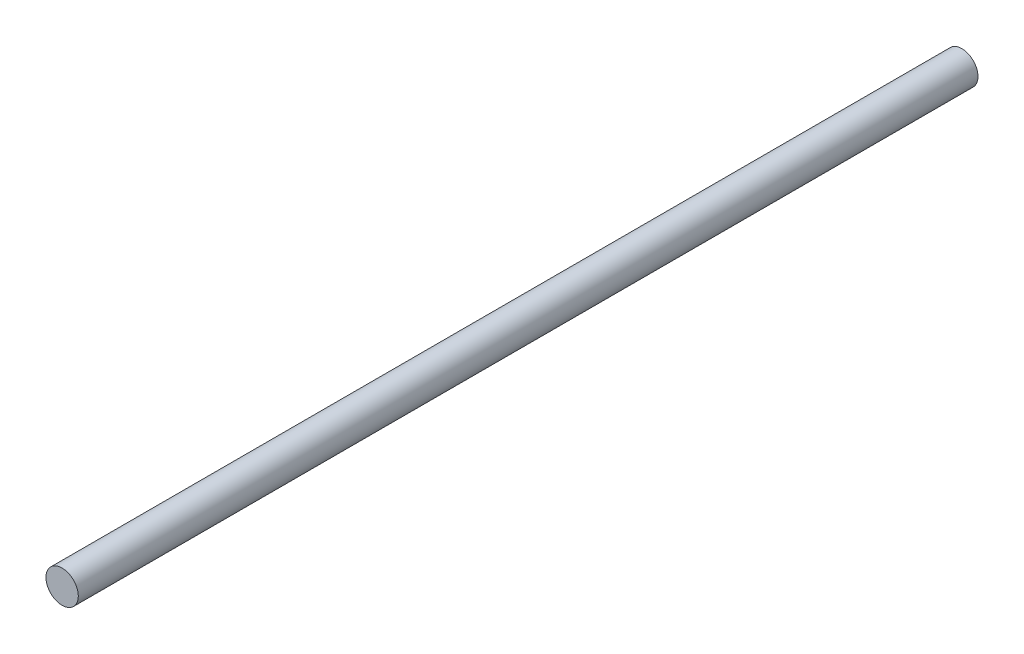
ISO-10303-21;
HEADER;
FILE_DESCRIPTION(('STEP AP214'),'2;1');
FILE_NAME('part.step','',(''),(''),'','','');
FILE_SCHEMA(('AUTOMOTIVE_DESIGN { 1 0 10303 214 1 1 1 1 }'));
ENDSEC;
DATA;
#1=APPLICATION_CONTEXT('core data for automotive mechanical design processes');
#2=APPLICATION_PROTOCOL_DEFINITION('international standard','automotive_design',2000,#1);
#3=PRODUCT_CONTEXT('',#1,'mechanical');
#4=PRODUCT('Part','Part','',(#3));
#5=PRODUCT_RELATED_PRODUCT_CATEGORY('part','',(#4));
#6=PRODUCT_DEFINITION_FORMATION('','',#4);
#7=PRODUCT_DEFINITION_CONTEXT('part definition',#1,'design');
#8=PRODUCT_DEFINITION('design','',#6,#7);
#9=PRODUCT_DEFINITION_SHAPE('','',#8);
#10=(LENGTH_UNIT() NAMED_UNIT(*) SI_UNIT(.MILLI.,.METRE.));
#11=(NAMED_UNIT(*) PLANE_ANGLE_UNIT() SI_UNIT($,.RADIAN.));
#12=(NAMED_UNIT(*) SI_UNIT($,.STERADIAN.) SOLID_ANGLE_UNIT());
#13=UNCERTAINTY_MEASURE_WITH_UNIT(LENGTH_MEASURE(1.E-05),#10,'distance_accuracy_value','');
#14=(GEOMETRIC_REPRESENTATION_CONTEXT(3) GLOBAL_UNCERTAINTY_ASSIGNED_CONTEXT((#13)) GLOBAL_UNIT_ASSIGNED_CONTEXT((#10,
#11,#12)) REPRESENTATION_CONTEXT('',''));
#15=CARTESIAN_POINT('',(0.,0.,0.));
#16=DIRECTION('',(0.,0.,1.));
#17=DIRECTION('',(1.,0.,0.));
#18=AXIS2_PLACEMENT_3D('',#15,#16,#17);
#19=CARTESIAN_POINT('',(0.,0.,334.));
#20=DIRECTION('',(0.,0.,-1.));
#21=DIRECTION('',(-1.,0.,0.));
#22=AXIS2_PLACEMENT_3D('',#19,#20,#21);
#23=CYLINDRICAL_SURFACE('',#22,6.);
#24=CARTESIAN_POINT('',(0.,0.,334.));
#25=DIRECTION('',(0.,0.,1.));
#26=DIRECTION('',(1.,0.,0.));
#27=AXIS2_PLACEMENT_3D('',#24,#25,#26);
#28=CIRCLE('',#27,6.);
#29=CARTESIAN_POINT('',(6.,0.,334.));
#30=VERTEX_POINT('',#29);
#31=EDGE_CURVE('E10',#30,#30,#28,.T.);
#32=ORIENTED_EDGE('',*,*,#31,.F.);
#33=EDGE_LOOP('',(#32));
#34=FACE_BOUND('',#33,.T.);
#35=CARTESIAN_POINT('',(0.,0.,0.));
#36=DIRECTION('',(0.,0.,1.));
#37=DIRECTION('',(1.,0.,0.));
#38=AXIS2_PLACEMENT_3D('',#35,#36,#37);
#39=CIRCLE('',#38,6.);
#40=CARTESIAN_POINT('',(6.,0.,0.));
#41=VERTEX_POINT('',#40);
#42=EDGE_CURVE('E34',#41,#41,#39,.T.);
#43=ORIENTED_EDGE('',*,*,#42,.T.);
#44=EDGE_LOOP('',(#43));
#45=FACE_BOUND('',#44,.T.);
#46=ADVANCED_FACE('F31',(#34,#45),#23,.T.);
#47=CARTESIAN_POINT('',(0.,0.,334.));
#48=DIRECTION('',(0.,0.,1.));
#49=DIRECTION('',(1.,0.,0.));
#50=AXIS2_PLACEMENT_3D('',#47,#48,#49);
#51=PLANE('',#50);
#52=ORIENTED_EDGE('',*,*,#31,.T.);
#53=EDGE_LOOP('',(#52));
#54=FACE_BOUND('',#53,.T.);
#55=ADVANCED_FACE('F46',(#54),#51,.T.);
#56=CARTESIAN_POINT('',(0.,0.,0.));
#57=DIRECTION('',(0.,0.,1.));
#58=DIRECTION('',(1.,0.,0.));
#59=AXIS2_PLACEMENT_3D('',#56,#57,#58);
#60=PLANE('',#59);
#61=ORIENTED_EDGE('',*,*,#42,.F.);
#62=EDGE_LOOP('',(#61));
#63=FACE_BOUND('',#62,.T.);
#64=ADVANCED_FACE('F44',(#63),#60,.F.);
#65=CLOSED_SHELL('',(#46,#55,#64));
#66=MANIFOLD_SOLID_BREP('B2',#65);
#67=ADVANCED_BREP_SHAPE_REPRESENTATION('',(#18,#66),#14);
#68=SHAPE_DEFINITION_REPRESENTATION(#9,#67);
ENDSEC;
END-ISO-10303-21;
